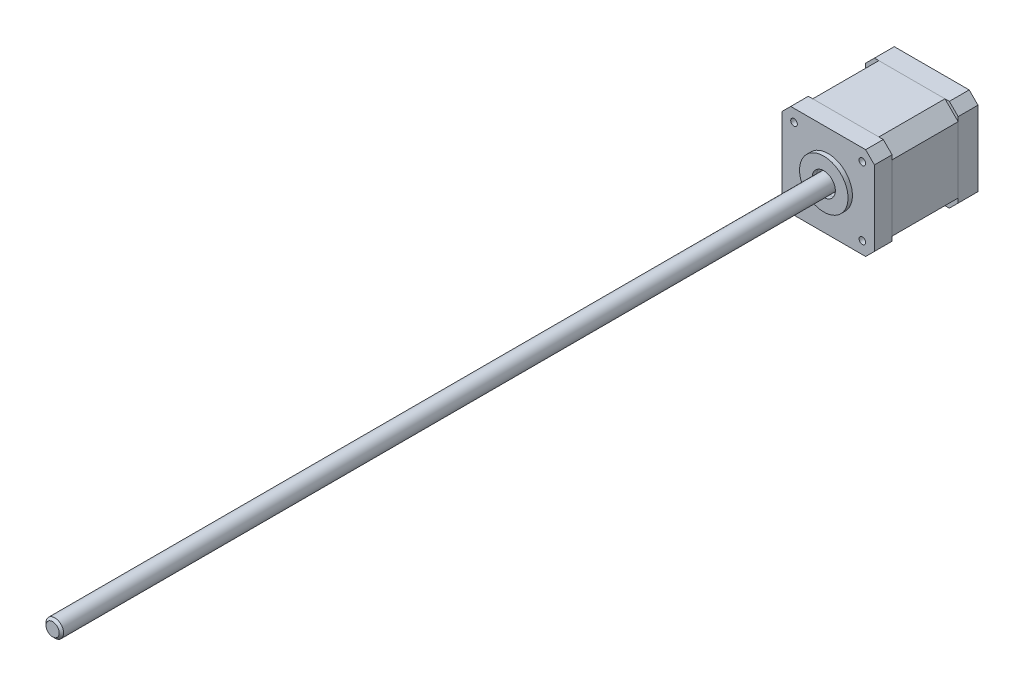
ISO-10303-21;
HEADER;
FILE_DESCRIPTION(('STEP AP214'),'2;1');
FILE_NAME('part.step','',(''),(''),'','','');
FILE_SCHEMA(('AUTOMOTIVE_DESIGN { 1 0 10303 214 1 1 1 1 }'));
ENDSEC;
DATA;
#1=APPLICATION_CONTEXT('core data for automotive mechanical design processes');
#2=APPLICATION_PROTOCOL_DEFINITION('international standard','automotive_design',2000,#1);
#3=PRODUCT_CONTEXT('',#1,'mechanical');
#4=PRODUCT('Part','Part','',(#3));
#5=PRODUCT_RELATED_PRODUCT_CATEGORY('part','',(#4));
#6=PRODUCT_DEFINITION_FORMATION('','',#4);
#7=PRODUCT_DEFINITION_CONTEXT('part definition',#1,'design');
#8=PRODUCT_DEFINITION('design','',#6,#7);
#9=PRODUCT_DEFINITION_SHAPE('','',#8);
#10=(LENGTH_UNIT() NAMED_UNIT(*) SI_UNIT(.MILLI.,.METRE.));
#11=(NAMED_UNIT(*) PLANE_ANGLE_UNIT() SI_UNIT($,.RADIAN.));
#12=(NAMED_UNIT(*) SI_UNIT($,.STERADIAN.) SOLID_ANGLE_UNIT());
#13=UNCERTAINTY_MEASURE_WITH_UNIT(LENGTH_MEASURE(1.E-05),#10,'distance_accuracy_value','');
#14=(GEOMETRIC_REPRESENTATION_CONTEXT(3) GLOBAL_UNCERTAINTY_ASSIGNED_CONTEXT((#13)) GLOBAL_UNIT_ASSIGNED_CONTEXT((#10,
#11,#12)) REPRESENTATION_CONTEXT('',''));
#15=CARTESIAN_POINT('',(0.,0.,0.));
#16=DIRECTION('',(0.,0.,1.));
#17=DIRECTION('',(1.,0.,0.));
#18=AXIS2_PLACEMENT_3D('',#15,#16,#17);
#19=CARTESIAN_POINT('',(0.,0.,736.313708498985));
#20=DIRECTION('',(0.,0.,-1.));
#21=DIRECTION('',(-1.,0.,0.));
#22=AXIS2_PLACEMENT_3D('',#19,#20,#21);
#23=CYLINDRICAL_SURFACE('',#22,4.);
#24=CARTESIAN_POINT('',(0.,0.,374.));
#25=DIRECTION('',(0.,0.,1.));
#26=DIRECTION('',(1.,0.,0.));
#27=AXIS2_PLACEMENT_3D('',#24,#25,#26);
#28=CIRCLE('',#27,4.);
#29=CARTESIAN_POINT('',(4.,0.,374.));
#30=VERTEX_POINT('',#29);
#31=EDGE_CURVE('E11',#30,#30,#28,.F.);
#32=ORIENTED_EDGE('',*,*,#31,.T.);
#33=EDGE_LOOP('',(#32));
#34=FACE_BOUND('',#33,.T.);
#35=CARTESIAN_POINT('',(0.,0.,23.));
#36=DIRECTION('',(0.,0.,1.));
#37=DIRECTION('',(1.,0.,0.));
#38=AXIS2_PLACEMENT_3D('',#35,#36,#37);
#39=CIRCLE('',#38,4.);
#40=CARTESIAN_POINT('',(4.,0.,23.));
#41=VERTEX_POINT('',#40);
#42=EDGE_CURVE('E56',#41,#41,#39,.T.);
#43=ORIENTED_EDGE('',*,*,#42,.T.);
#44=EDGE_LOOP('',(#43));
#45=FACE_BOUND('',#44,.T.);
#46=ADVANCED_FACE('F45',(#34,#45),#23,.T.);
#47=CARTESIAN_POINT('',(0.,0.,23.));
#48=DIRECTION('',(0.,0.,1.));
#49=DIRECTION('',(1.,0.,0.));
#50=AXIS2_PLACEMENT_3D('',#47,#48,#49);
#51=PLANE('',#50);
#52=ORIENTED_EDGE('',*,*,#42,.F.);
#53=EDGE_LOOP('',(#52));
#54=FACE_BOUND('',#53,.T.);
#55=ADVANCED_FACE('F64',(#54),#51,.F.);
#56=CARTESIAN_POINT('',(0.,0.,375.));
#57=DIRECTION('',(0.,0.,1.));
#58=DIRECTION('',(1.,0.,0.));
#59=AXIS2_PLACEMENT_3D('',#56,#57,#58);
#60=PLANE('',#59);
#61=CARTESIAN_POINT('',(0.,0.,375.));
#62=DIRECTION('',(0.,0.,1.));
#63=DIRECTION('',(1.,0.,0.));
#64=AXIS2_PLACEMENT_3D('',#61,#62,#63);
#65=CIRCLE('',#64,3.00000000000006);
#66=CARTESIAN_POINT('',(3.00000000000006,0.,375.));
#67=VERTEX_POINT('',#66);
#68=EDGE_CURVE('E52',#67,#67,#65,.T.);
#69=ORIENTED_EDGE('',*,*,#68,.T.);
#70=EDGE_LOOP('',(#69));
#71=FACE_BOUND('',#70,.T.);
#72=ADVANCED_FACE('F66',(#71),#60,.T.);
#73=CARTESIAN_POINT('',(0.,0.,375.));
#74=DIRECTION('',(0.,0.,-1.));
#75=DIRECTION('',(-1.,0.,0.));
#76=AXIS2_PLACEMENT_3D('',#73,#74,#75);
#77=CONICAL_SURFACE('',#76,3.00000000000006,0.785398163397447);
#78=ORIENTED_EDGE('',*,*,#31,.F.);
#79=EDGE_LOOP('',(#78));
#80=FACE_BOUND('',#79,.T.);
#81=ORIENTED_EDGE('',*,*,#68,.F.);
#82=EDGE_LOOP('',(#81));
#83=FACE_BOUND('',#82,.T.);
#84=ADVANCED_FACE('F47',(#80,#83),#77,.T.);
#85=CLOSED_SHELL('',(#46,#55,#72,#84));
#86=MANIFOLD_SOLID_BREP('B2',#85);
#87=CARTESIAN_POINT('',(0.,0.,25.));
#88=DIRECTION('',(0.,0.,-1.));
#89=DIRECTION('',(-1.,0.,0.));
#90=AXIS2_PLACEMENT_3D('',#87,#88,#89);
#91=CYLINDRICAL_SURFACE('',#90,11.);
#92=CARTESIAN_POINT('',(0.,0.,25.));
#93=DIRECTION('',(0.,0.,1.));
#94=DIRECTION('',(1.,0.,0.));
#95=AXIS2_PLACEMENT_3D('',#92,#93,#94);
#96=CIRCLE('',#95,11.);
#97=CARTESIAN_POINT('',(11.,0.,25.));
#98=VERTEX_POINT('',#97);
#99=EDGE_CURVE('E44',#98,#98,#96,.T.);
#100=ORIENTED_EDGE('',*,*,#99,.F.);
#101=EDGE_LOOP('',(#100));
#102=FACE_BOUND('',#101,.T.);
#103=CARTESIAN_POINT('',(0.,0.,23.));
#104=DIRECTION('',(0.,0.,1.));
#105=DIRECTION('',(1.,0.,0.));
#106=AXIS2_PLACEMENT_3D('',#103,#104,#105);
#107=CIRCLE('',#106,11.);
#108=CARTESIAN_POINT('',(11.,0.,23.));
#109=VERTEX_POINT('',#108);
#110=EDGE_CURVE('E118',#109,#109,#107,.T.);
#111=ORIENTED_EDGE('',*,*,#110,.T.);
#112=EDGE_LOOP('',(#111));
#113=FACE_BOUND('',#112,.T.);
#114=ADVANCED_FACE('F111',(#102,#113),#91,.T.);
#115=CARTESIAN_POINT('',(0.,0.,25.));
#116=DIRECTION('',(0.,0.,1.));
#117=DIRECTION('',(1.,0.,0.));
#118=AXIS2_PLACEMENT_3D('',#115,#116,#117);
#119=PLANE('',#118);
#120=CARTESIAN_POINT('',(0.,0.,25.));
#121=DIRECTION('',(0.,0.,1.));
#122=DIRECTION('',(1.,0.,0.));
#123=AXIS2_PLACEMENT_3D('',#120,#121,#122);
#124=CIRCLE('',#123,5.25);
#125=CARTESIAN_POINT('',(5.25,0.,25.));
#126=VERTEX_POINT('',#125);
#127=EDGE_CURVE('E124',#126,#126,#124,.T.);
#128=ORIENTED_EDGE('',*,*,#127,.F.);
#129=EDGE_LOOP('',(#128));
#130=FACE_BOUND('',#129,.T.);
#131=ORIENTED_EDGE('',*,*,#99,.T.);
#132=EDGE_LOOP('',(#131));
#133=FACE_BOUND('',#132,.T.);
#134=ADVANCED_FACE('F140',(#130,#133),#119,.T.);
#135=CARTESIAN_POINT('',(0.,0.,23.));
#136=DIRECTION('',(0.,0.,1.));
#137=DIRECTION('',(1.,0.,0.));
#138=AXIS2_PLACEMENT_3D('',#135,#136,#137);
#139=PLANE('',#138);
#140=CARTESIAN_POINT('',(0.,0.,23.));
#141=DIRECTION('',(0.,0.,1.));
#142=DIRECTION('',(1.,0.,0.));
#143=AXIS2_PLACEMENT_3D('',#140,#141,#142);
#144=CIRCLE('',#143,5.25);
#145=CARTESIAN_POINT('',(5.25,0.,23.));
#146=VERTEX_POINT('',#145);
#147=EDGE_CURVE('E114',#146,#146,#144,.T.);
#148=ORIENTED_EDGE('',*,*,#147,.T.);
#149=EDGE_LOOP('',(#148));
#150=FACE_BOUND('',#149,.T.);
#151=ORIENTED_EDGE('',*,*,#110,.F.);
#152=EDGE_LOOP('',(#151));
#153=FACE_BOUND('',#152,.T.);
#154=ADVANCED_FACE('F131',(#150,#153),#139,.F.);
#155=CARTESIAN_POINT('',(0.,0.,20.));
#156=DIRECTION('',(0.,0.,1.));
#157=DIRECTION('',(1.,0.,0.));
#158=AXIS2_PLACEMENT_3D('',#155,#156,#157);
#159=CYLINDRICAL_SURFACE('',#158,5.25);
#160=ORIENTED_EDGE('',*,*,#127,.T.);
#161=EDGE_LOOP('',(#160));
#162=FACE_BOUND('',#161,.T.);
#163=ORIENTED_EDGE('',*,*,#147,.F.);
#164=EDGE_LOOP('',(#163));
#165=FACE_BOUND('',#164,.T.);
#166=ADVANCED_FACE('F134',(#162,#165),#159,.F.);
#167=CLOSED_SHELL('',(#114,#134,#154,#166));
#168=MANIFOLD_SOLID_BREP('B6',#167);
#169=CARTESIAN_POINT('',(-21.,-21.,-24.));
#170=DIRECTION('',(1.,0.,0.));
#171=DIRECTION('',(0.,0.,-1.));
#172=AXIS2_PLACEMENT_3D('',#169,#170,#171);
#173=PLANE('',#172);
#174=DIRECTION('',(0.,1.,0.));
#175=VECTOR('',#174,1.);
#176=CARTESIAN_POINT('',(-21.,-21.,-24.));
#177=LINE('',#176,#175);
#178=CARTESIAN_POINT('',(-21.,-17.,-24.));
#179=VERTEX_POINT('',#178);
#180=CARTESIAN_POINT('',(-21.,17.,-24.));
#181=VERTEX_POINT('',#180);
#182=EDGE_CURVE('E272',#179,#181,#177,.T.);
#183=ORIENTED_EDGE('',*,*,#182,.F.);
#184=DIRECTION('',(0.,0.,1.));
#185=VECTOR('',#184,1.);
#186=CARTESIAN_POINT('',(-21.,-17.,-24.));
#187=LINE('',#186,#185);
#188=CARTESIAN_POINT('',(-21.,-17.,-15.));
#189=VERTEX_POINT('',#188);
#190=EDGE_CURVE('E257',#179,#189,#187,.T.);
#191=ORIENTED_EDGE('',*,*,#190,.T.);
#192=DIRECTION('',(0.,1.,0.));
#193=VECTOR('',#192,1.);
#194=CARTESIAN_POINT('',(-21.,-21.,-15.));
#195=LINE('',#194,#193);
#196=CARTESIAN_POINT('',(-21.,17.,-15.));
#197=VERTEX_POINT('',#196);
#198=EDGE_CURVE('E269',#189,#197,#195,.T.);
#199=ORIENTED_EDGE('',*,*,#198,.T.);
#200=DIRECTION('',(0.,0.,-1.));
#201=VECTOR('',#200,1.);
#202=CARTESIAN_POINT('',(-21.,17.,-24.));
#203=LINE('',#202,#201);
#204=EDGE_CURVE('E274',#197,#181,#203,.T.);
#205=ORIENTED_EDGE('',*,*,#204,.T.);
#206=EDGE_LOOP('',(#183,#191,#199,#205));
#207=FACE_BOUND('',#206,.T.);
#208=ADVANCED_FACE('F186',(#207),#173,.F.);
#209=CARTESIAN_POINT('',(21.,21.,-24.));
#210=DIRECTION('',(0.,-1.,0.));
#211=DIRECTION('',(0.,0.,-1.));
#212=AXIS2_PLACEMENT_3D('',#209,#210,#211);
#213=PLANE('',#212);
#214=DIRECTION('',(1.,0.,0.));
#215=VECTOR('',#214,1.);
#216=CARTESIAN_POINT('',(21.,21.,-24.));
#217=LINE('',#216,#215);
#218=CARTESIAN_POINT('',(-17.,21.,-24.));
#219=VERTEX_POINT('',#218);
#220=CARTESIAN_POINT('',(17.,21.,-24.));
#221=VERTEX_POINT('',#220);
#222=EDGE_CURVE('E312',#219,#221,#217,.T.);
#223=ORIENTED_EDGE('',*,*,#222,.F.);
#224=DIRECTION('',(0.,0.,1.));
#225=VECTOR('',#224,1.);
#226=CARTESIAN_POINT('',(-17.,21.,-24.));
#227=LINE('',#226,#225);
#228=CARTESIAN_POINT('',(-17.,21.,-15.));
#229=VERTEX_POINT('',#228);
#230=EDGE_CURVE('E109',#219,#229,#227,.T.);
#231=ORIENTED_EDGE('',*,*,#230,.T.);
#232=DIRECTION('',(1.,0.,0.));
#233=VECTOR('',#232,1.);
#234=CARTESIAN_POINT('',(21.,21.,-15.));
#235=LINE('',#234,#233);
#236=CARTESIAN_POINT('',(17.,21.,-15.));
#237=VERTEX_POINT('',#236);
#238=EDGE_CURVE('E279',#229,#237,#235,.T.);
#239=ORIENTED_EDGE('',*,*,#238,.T.);
#240=DIRECTION('',(0.,0.,-1.));
#241=VECTOR('',#240,1.);
#242=CARTESIAN_POINT('',(17.,21.,-24.));
#243=LINE('',#242,#241);
#244=EDGE_CURVE('E194',#237,#221,#243,.T.);
#245=ORIENTED_EDGE('',*,*,#244,.T.);
#246=EDGE_LOOP('',(#223,#231,#239,#245));
#247=FACE_BOUND('',#246,.T.);
#248=ADVANCED_FACE('F311',(#247),#213,.F.);
#249=CARTESIAN_POINT('',(21.,-21.,-24.));
#250=DIRECTION('',(-1.,0.,0.));
#251=DIRECTION('',(0.,0.,1.));
#252=AXIS2_PLACEMENT_3D('',#249,#250,#251);
#253=PLANE('',#252);
#254=DIRECTION('',(0.,-1.,0.));
#255=VECTOR('',#254,1.);
#256=CARTESIAN_POINT('',(21.,-21.,-15.));
#257=LINE('',#256,#255);
#258=CARTESIAN_POINT('',(21.,17.,-15.));
#259=VERTEX_POINT('',#258);
#260=CARTESIAN_POINT('',(21.,-17.,-15.));
#261=VERTEX_POINT('',#260);
#262=EDGE_CURVE('E282',#259,#261,#257,.T.);
#263=ORIENTED_EDGE('',*,*,#262,.T.);
#264=DIRECTION('',(0.,0.,-1.));
#265=VECTOR('',#264,1.);
#266=CARTESIAN_POINT('',(21.,-17.,-24.));
#267=LINE('',#266,#265);
#268=CARTESIAN_POINT('',(21.,-17.,-24.));
#269=VERTEX_POINT('',#268);
#270=EDGE_CURVE('E201',#261,#269,#267,.T.);
#271=ORIENTED_EDGE('',*,*,#270,.T.);
#272=DIRECTION('',(0.,-1.,0.));
#273=VECTOR('',#272,1.);
#274=CARTESIAN_POINT('',(21.,-21.,-24.));
#275=LINE('',#274,#273);
#276=CARTESIAN_POINT('',(21.,17.,-24.));
#277=VERTEX_POINT('',#276);
#278=EDGE_CURVE('E318',#277,#269,#275,.T.);
#279=ORIENTED_EDGE('',*,*,#278,.F.);
#280=DIRECTION('',(0.,0.,1.));
#281=VECTOR('',#280,1.);
#282=CARTESIAN_POINT('',(21.,17.,-24.));
#283=LINE('',#282,#281);
#284=EDGE_CURVE('E305',#277,#259,#283,.T.);
#285=ORIENTED_EDGE('',*,*,#284,.T.);
#286=EDGE_LOOP('',(#263,#271,#279,#285));
#287=FACE_BOUND('',#286,.T.);
#288=ADVANCED_FACE('F322',(#287),#253,.F.);
#289=CARTESIAN_POINT('',(21.,-21.,-24.));
#290=DIRECTION('',(0.,1.,0.));
#291=DIRECTION('',(0.,0.,1.));
#292=AXIS2_PLACEMENT_3D('',#289,#290,#291);
#293=PLANE('',#292);
#294=DIRECTION('',(-1.,0.,0.));
#295=VECTOR('',#294,1.);
#296=CARTESIAN_POINT('',(21.,-21.,-15.));
#297=LINE('',#296,#295);
#298=CARTESIAN_POINT('',(17.,-21.,-15.));
#299=VERTEX_POINT('',#298);
#300=CARTESIAN_POINT('',(-17.,-21.,-15.));
#301=VERTEX_POINT('',#300);
#302=EDGE_CURVE('E289',#299,#301,#297,.T.);
#303=ORIENTED_EDGE('',*,*,#302,.T.);
#304=DIRECTION('',(0.,0.,-1.));
#305=VECTOR('',#304,1.);
#306=CARTESIAN_POINT('',(-17.,-21.,-24.));
#307=LINE('',#306,#305);
#308=CARTESIAN_POINT('',(-17.,-21.,-24.));
#309=VERTEX_POINT('',#308);
#310=EDGE_CURVE('E258',#301,#309,#307,.T.);
#311=ORIENTED_EDGE('',*,*,#310,.T.);
#312=DIRECTION('',(-1.,0.,0.));
#313=VECTOR('',#312,1.);
#314=CARTESIAN_POINT('',(21.,-21.,-24.));
#315=LINE('',#314,#313);
#316=CARTESIAN_POINT('',(17.,-21.,-24.));
#317=VERTEX_POINT('',#316);
#318=EDGE_CURVE('E285',#317,#309,#315,.T.);
#319=ORIENTED_EDGE('',*,*,#318,.F.);
#320=DIRECTION('',(0.,0.,1.));
#321=VECTOR('',#320,1.);
#322=CARTESIAN_POINT('',(17.,-21.,-24.));
#323=LINE('',#322,#321);
#324=EDGE_CURVE('E263',#317,#299,#323,.T.);
#325=ORIENTED_EDGE('',*,*,#324,.T.);
#326=EDGE_LOOP('',(#303,#311,#319,#325));
#327=FACE_BOUND('',#326,.T.);
#328=ADVANCED_FACE('F329',(#327),#293,.F.);
#329=CARTESIAN_POINT('',(0.,0.,-24.));
#330=DIRECTION('',(0.,0.,1.));
#331=DIRECTION('',(1.,0.,0.));
#332=AXIS2_PLACEMENT_3D('',#329,#330,#331);
#333=PLANE('',#332);
#334=ORIENTED_EDGE('',*,*,#318,.T.);
#335=DIRECTION('',(0.70710678118655,-0.707106781186545,0.));
#336=VECTOR('',#335,1.);
#337=CARTESIAN_POINT('',(-21.,-17.,-24.));
#338=LINE('',#337,#336);
#339=EDGE_CURVE('E303',#309,#179,#338,.F.);
#340=ORIENTED_EDGE('',*,*,#339,.T.);
#341=ORIENTED_EDGE('',*,*,#182,.T.);
#342=DIRECTION('',(-0.707106781186545,-0.70710678118655,0.));
#343=VECTOR('',#342,1.);
#344=CARTESIAN_POINT('',(-17.,21.,-24.));
#345=LINE('',#344,#343);
#346=EDGE_CURVE('E299',#181,#219,#345,.F.);
#347=ORIENTED_EDGE('',*,*,#346,.T.);
#348=ORIENTED_EDGE('',*,*,#222,.T.);
#349=DIRECTION('',(-0.707106781186549,0.707106781186546,0.));
#350=VECTOR('',#349,1.);
#351=CARTESIAN_POINT('',(21.,17.,-24.));
#352=LINE('',#351,#350);
#353=EDGE_CURVE('E208',#221,#277,#352,.F.);
#354=ORIENTED_EDGE('',*,*,#353,.T.);
#355=ORIENTED_EDGE('',*,*,#278,.T.);
#356=DIRECTION('',(0.707106781186546,0.707106781186549,0.));
#357=VECTOR('',#356,1.);
#358=CARTESIAN_POINT('',(17.,-21.,-24.));
#359=LINE('',#358,#357);
#360=EDGE_CURVE('E301',#269,#317,#359,.F.);
#361=ORIENTED_EDGE('',*,*,#360,.T.);
#362=EDGE_LOOP('',(#334,#340,#341,#347,#348,#354,#355,#361));
#363=FACE_BOUND('',#362,.T.);
#364=ADVANCED_FACE('F316',(#363),#333,.F.);
#365=CARTESIAN_POINT('',(0.,0.,-15.));
#366=DIRECTION('',(0.,0.,1.));
#367=DIRECTION('',(1.,0.,0.));
#368=AXIS2_PLACEMENT_3D('',#365,#366,#367);
#369=PLANE('',#368);
#370=ORIENTED_EDGE('',*,*,#198,.F.);
#371=DIRECTION('',(-0.70710678118655,0.707106781186545,0.));
#372=VECTOR('',#371,1.);
#373=CARTESIAN_POINT('',(-18.9999999999999,-19.0000000000001,-15.));
#374=LINE('',#373,#372);
#375=EDGE_CURVE('E253',#189,#301,#374,.F.);
#376=ORIENTED_EDGE('',*,*,#375,.T.);
#377=ORIENTED_EDGE('',*,*,#302,.F.);
#378=DIRECTION('',(-0.707106781186546,-0.707106781186549,0.));
#379=VECTOR('',#378,1.);
#380=CARTESIAN_POINT('',(19.,-19.,-15.));
#381=LINE('',#380,#379);
#382=EDGE_CURVE('E264',#299,#261,#381,.F.);
#383=ORIENTED_EDGE('',*,*,#382,.T.);
#384=ORIENTED_EDGE('',*,*,#262,.F.);
#385=DIRECTION('',(0.707106781186549,-0.707106781186546,0.));
#386=VECTOR('',#385,1.);
#387=CARTESIAN_POINT('',(18.9999999999999,19.,-15.));
#388=LINE('',#387,#386);
#389=EDGE_CURVE('E273',#259,#237,#388,.F.);
#390=ORIENTED_EDGE('',*,*,#389,.T.);
#391=ORIENTED_EDGE('',*,*,#238,.F.);
#392=DIRECTION('',(0.707106781186545,0.70710678118655,0.));
#393=VECTOR('',#392,1.);
#394=CARTESIAN_POINT('',(-19.0000000000001,18.9999999999999,-15.));
#395=LINE('',#394,#393);
#396=EDGE_CURVE('E278',#229,#197,#395,.F.);
#397=ORIENTED_EDGE('',*,*,#396,.T.);
#398=EDGE_LOOP('',(#370,#376,#377,#383,#384,#390,#391,#397));
#399=FACE_BOUND('',#398,.T.);
#400=ADVANCED_FACE('F276',(#399),#369,.T.);
#401=CARTESIAN_POINT('',(-21.,-17.,-24.));
#402=DIRECTION('',(0.707106781186545,0.70710678118655,0.));
#403=DIRECTION('',(0.,0.,1.));
#404=AXIS2_PLACEMENT_3D('',#401,#402,#403);
#405=PLANE('',#404);
#406=ORIENTED_EDGE('',*,*,#339,.F.);
#407=ORIENTED_EDGE('',*,*,#310,.F.);
#408=ORIENTED_EDGE('',*,*,#375,.F.);
#409=ORIENTED_EDGE('',*,*,#190,.F.);
#410=EDGE_LOOP('',(#406,#407,#408,#409));
#411=FACE_BOUND('',#410,.T.);
#412=ADVANCED_FACE('F256',(#411),#405,.F.);
#413=CARTESIAN_POINT('',(17.,-21.,-24.));
#414=DIRECTION('',(-0.707106781186549,0.707106781186546,0.));
#415=DIRECTION('',(0.,0.,1.));
#416=AXIS2_PLACEMENT_3D('',#413,#414,#415);
#417=PLANE('',#416);
#418=ORIENTED_EDGE('',*,*,#360,.F.);
#419=ORIENTED_EDGE('',*,*,#270,.F.);
#420=ORIENTED_EDGE('',*,*,#382,.F.);
#421=ORIENTED_EDGE('',*,*,#324,.F.);
#422=EDGE_LOOP('',(#418,#419,#420,#421));
#423=FACE_BOUND('',#422,.T.);
#424=ADVANCED_FACE('F326',(#423),#417,.F.);
#425=CARTESIAN_POINT('',(-17.,21.,-24.));
#426=DIRECTION('',(0.70710678118655,-0.707106781186545,0.));
#427=DIRECTION('',(0.,0.,1.));
#428=AXIS2_PLACEMENT_3D('',#425,#426,#427);
#429=PLANE('',#428);
#430=ORIENTED_EDGE('',*,*,#346,.F.);
#431=ORIENTED_EDGE('',*,*,#204,.F.);
#432=ORIENTED_EDGE('',*,*,#396,.F.);
#433=ORIENTED_EDGE('',*,*,#230,.F.);
#434=EDGE_LOOP('',(#430,#431,#432,#433));
#435=FACE_BOUND('',#434,.T.);
#436=ADVANCED_FACE('F332',(#435),#429,.F.);
#437=CARTESIAN_POINT('',(21.,17.,-24.));
#438=DIRECTION('',(-0.707106781186546,-0.707106781186549,0.));
#439=DIRECTION('',(0.,0.,1.));
#440=AXIS2_PLACEMENT_3D('',#437,#438,#439);
#441=PLANE('',#440);
#442=ORIENTED_EDGE('',*,*,#353,.F.);
#443=ORIENTED_EDGE('',*,*,#244,.F.);
#444=ORIENTED_EDGE('',*,*,#389,.F.);
#445=ORIENTED_EDGE('',*,*,#284,.F.);
#446=EDGE_LOOP('',(#442,#443,#444,#445));
#447=FACE_BOUND('',#446,.T.);
#448=ADVANCED_FACE('F188',(#447),#441,.F.);
#449=CLOSED_SHELL('',(#208,#248,#288,#328,#364,#400,#412,#424,#436,#448));
#450=MANIFOLD_SOLID_BREP('B39',#449);
#451=CARTESIAN_POINT('',(21.,-21.,23.));
#452=DIRECTION('',(-1.,0.,0.));
#453=DIRECTION('',(0.,0.,1.));
#454=AXIS2_PLACEMENT_3D('',#451,#452,#453);
#455=PLANE('',#454);
#456=DIRECTION('',(0.,1.,0.));
#457=VECTOR('',#456,1.);
#458=CARTESIAN_POINT('',(21.,-21.,23.));
#459=LINE('',#458,#457);
#460=CARTESIAN_POINT('',(21.,-17.,23.));
#461=VERTEX_POINT('',#460);
#462=CARTESIAN_POINT('',(21.,17.,23.));
#463=VERTEX_POINT('',#462);
#464=EDGE_CURVE('E515',#461,#463,#459,.T.);
#465=ORIENTED_EDGE('',*,*,#464,.F.);
#466=DIRECTION('',(0.,0.,-1.));
#467=VECTOR('',#466,1.);
#468=CARTESIAN_POINT('',(21.,-17.,23.));
#469=LINE('',#468,#467);
#470=CARTESIAN_POINT('',(21.,-17.,15.));
#471=VERTEX_POINT('',#470);
#472=EDGE_CURVE('E541',#461,#471,#469,.T.);
#473=ORIENTED_EDGE('',*,*,#472,.T.);
#474=DIRECTION('',(0.,1.,0.));
#475=VECTOR('',#474,1.);
#476=CARTESIAN_POINT('',(21.,-21.,15.));
#477=LINE('',#476,#475);
#478=CARTESIAN_POINT('',(21.,17.,15.));
#479=VERTEX_POINT('',#478);
#480=EDGE_CURVE('E548',#471,#479,#477,.T.);
#481=ORIENTED_EDGE('',*,*,#480,.T.);
#482=DIRECTION('',(0.,0.,1.));
#483=VECTOR('',#482,1.);
#484=CARTESIAN_POINT('',(21.,17.,23.));
#485=LINE('',#484,#483);
#486=EDGE_CURVE('E539',#479,#463,#485,.T.);
#487=ORIENTED_EDGE('',*,*,#486,.T.);
#488=EDGE_LOOP('',(#465,#473,#481,#487));
#489=FACE_BOUND('',#488,.T.);
#490=ADVANCED_FACE('F422',(#489),#455,.F.);
#491=CARTESIAN_POINT('',(-21.,21.,23.));
#492=DIRECTION('',(0.,-1.,0.));
#493=DIRECTION('',(0.,0.,-1.));
#494=AXIS2_PLACEMENT_3D('',#491,#492,#493);
#495=PLANE('',#494);
#496=DIRECTION('',(-1.,0.,0.));
#497=VECTOR('',#496,1.);
#498=CARTESIAN_POINT('',(-21.,21.,23.));
#499=LINE('',#498,#497);
#500=CARTESIAN_POINT('',(17.,21.,23.));
#501=VERTEX_POINT('',#500);
#502=CARTESIAN_POINT('',(-17.,21.,23.));
#503=VERTEX_POINT('',#502);
#504=EDGE_CURVE('E518',#501,#503,#499,.T.);
#505=ORIENTED_EDGE('',*,*,#504,.F.);
#506=DIRECTION('',(0.,0.,-1.));
#507=VECTOR('',#506,1.);
#508=CARTESIAN_POINT('',(17.,21.,23.));
#509=LINE('',#508,#507);
#510=CARTESIAN_POINT('',(17.,21.,15.));
#511=VERTEX_POINT('',#510);
#512=EDGE_CURVE('E184',#501,#511,#509,.T.);
#513=ORIENTED_EDGE('',*,*,#512,.T.);
#514=DIRECTION('',(-1.,0.,0.));
#515=VECTOR('',#514,1.);
#516=CARTESIAN_POINT('',(-21.,21.,15.));
#517=LINE('',#516,#515);
#518=CARTESIAN_POINT('',(-17.,21.,15.));
#519=VERTEX_POINT('',#518);
#520=EDGE_CURVE('E520',#511,#519,#517,.T.);
#521=ORIENTED_EDGE('',*,*,#520,.T.);
#522=DIRECTION('',(0.,0.,1.));
#523=VECTOR('',#522,1.);
#524=CARTESIAN_POINT('',(-17.,21.,23.));
#525=LINE('',#524,#523);
#526=EDGE_CURVE('E431',#519,#503,#525,.T.);
#527=ORIENTED_EDGE('',*,*,#526,.T.);
#528=EDGE_LOOP('',(#505,#513,#521,#527));
#529=FACE_BOUND('',#528,.T.);
#530=ADVANCED_FACE('F608',(#529),#495,.F.);
#531=CARTESIAN_POINT('',(-21.,-21.,23.));
#532=DIRECTION('',(1.,0.,0.));
#533=DIRECTION('',(0.,0.,-1.));
#534=AXIS2_PLACEMENT_3D('',#531,#532,#533);
#535=PLANE('',#534);
#536=DIRECTION('',(0.,-1.,0.));
#537=VECTOR('',#536,1.);
#538=CARTESIAN_POINT('',(-21.,-21.,15.));
#539=LINE('',#538,#537);
#540=CARTESIAN_POINT('',(-21.,17.,15.));
#541=VERTEX_POINT('',#540);
#542=CARTESIAN_POINT('',(-21.,-17.,15.));
#543=VERTEX_POINT('',#542);
#544=EDGE_CURVE('E516',#541,#543,#539,.T.);
#545=ORIENTED_EDGE('',*,*,#544,.T.);
#546=DIRECTION('',(0.,0.,1.));
#547=VECTOR('',#546,1.);
#548=CARTESIAN_POINT('',(-21.,-17.,23.));
#549=LINE('',#548,#547);
#550=CARTESIAN_POINT('',(-21.,-17.,23.));
#551=VERTEX_POINT('',#550);
#552=EDGE_CURVE('E494',#543,#551,#549,.T.);
#553=ORIENTED_EDGE('',*,*,#552,.T.);
#554=DIRECTION('',(0.,-1.,0.));
#555=VECTOR('',#554,1.);
#556=CARTESIAN_POINT('',(-21.,-21.,23.));
#557=LINE('',#556,#555);
#558=CARTESIAN_POINT('',(-21.,17.,23.));
#559=VERTEX_POINT('',#558);
#560=EDGE_CURVE('E558',#559,#551,#557,.T.);
#561=ORIENTED_EDGE('',*,*,#560,.F.);
#562=DIRECTION('',(0.,0.,-1.));
#563=VECTOR('',#562,1.);
#564=CARTESIAN_POINT('',(-21.,17.,23.));
#565=LINE('',#564,#563);
#566=EDGE_CURVE('E499',#559,#541,#565,.T.);
#567=ORIENTED_EDGE('',*,*,#566,.T.);
#568=EDGE_LOOP('',(#545,#553,#561,#567));
#569=FACE_BOUND('',#568,.T.);
#570=ADVANCED_FACE('F606',(#569),#535,.F.);
#571=CARTESIAN_POINT('',(-21.,-21.,23.));
#572=DIRECTION('',(0.,1.,0.));
#573=DIRECTION('',(0.,0.,1.));
#574=AXIS2_PLACEMENT_3D('',#571,#572,#573);
#575=PLANE('',#574);
#576=DIRECTION('',(1.,0.,0.));
#577=VECTOR('',#576,1.);
#578=CARTESIAN_POINT('',(-21.,-21.,23.));
#579=LINE('',#578,#577);
#580=CARTESIAN_POINT('',(-17.,-21.,23.));
#581=VERTEX_POINT('',#580);
#582=CARTESIAN_POINT('',(17.,-21.,23.));
#583=VERTEX_POINT('',#582);
#584=EDGE_CURVE('E509',#581,#583,#579,.T.);
#585=ORIENTED_EDGE('',*,*,#584,.F.);
#586=DIRECTION('',(0.,0.,-1.));
#587=VECTOR('',#586,1.);
#588=CARTESIAN_POINT('',(-17.,-21.,23.));
#589=LINE('',#588,#587);
#590=CARTESIAN_POINT('',(-17.,-21.,15.));
#591=VERTEX_POINT('',#590);
#592=EDGE_CURVE('E493',#581,#591,#589,.T.);
#593=ORIENTED_EDGE('',*,*,#592,.T.);
#594=DIRECTION('',(1.,0.,0.));
#595=VECTOR('',#594,1.);
#596=CARTESIAN_POINT('',(-21.,-21.,15.));
#597=LINE('',#596,#595);
#598=CARTESIAN_POINT('',(17.,-21.,15.));
#599=VERTEX_POINT('',#598);
#600=EDGE_CURVE('E506',#591,#599,#597,.T.);
#601=ORIENTED_EDGE('',*,*,#600,.T.);
#602=DIRECTION('',(0.,0.,1.));
#603=VECTOR('',#602,1.);
#604=CARTESIAN_POINT('',(17.,-21.,23.));
#605=LINE('',#604,#603);
#606=EDGE_CURVE('E511',#599,#583,#605,.T.);
#607=ORIENTED_EDGE('',*,*,#606,.T.);
#608=EDGE_LOOP('',(#585,#593,#601,#607));
#609=FACE_BOUND('',#608,.T.);
#610=ADVANCED_FACE('F505',(#609),#575,.F.);
#611=CARTESIAN_POINT('',(0.,0.,23.));
#612=DIRECTION('',(0.,0.,-1.));
#613=DIRECTION('',(-1.,0.,0.));
#614=AXIS2_PLACEMENT_3D('',#611,#612,#613);
#615=PLANE('',#614);
#616=CARTESIAN_POINT('',(-15.4999999999999,-15.5000000000001,23.));
#617=DIRECTION('',(0.,0.,1.));
#618=DIRECTION('',(0.,1.,0.));
#619=AXIS2_PLACEMENT_3D('',#616,#617,#618);
#620=CIRCLE('',#619,1.5);
#621=CARTESIAN_POINT('',(-15.5,-14.0000000000001,23.));
#622=VERTEX_POINT('',#621);
#623=EDGE_CURVE('E581',#622,#622,#620,.T.);
#624=ORIENTED_EDGE('',*,*,#623,.F.);
#625=EDGE_LOOP('',(#624));
#626=FACE_BOUND('',#625,.T.);
#627=CARTESIAN_POINT('',(15.5,-15.5,23.));
#628=DIRECTION('',(0.,0.,1.));
#629=DIRECTION('',(-1.,0.,0.));
#630=AXIS2_PLACEMENT_3D('',#627,#628,#629);
#631=CIRCLE('',#630,1.5);
#632=CARTESIAN_POINT('',(14.,-15.5,23.));
#633=VERTEX_POINT('',#632);
#634=EDGE_CURVE('E574',#633,#633,#631,.T.);
#635=ORIENTED_EDGE('',*,*,#634,.F.);
#636=EDGE_LOOP('',(#635));
#637=FACE_BOUND('',#636,.T.);
#638=CARTESIAN_POINT('',(15.4999999999998,15.5000000000002,23.));
#639=DIRECTION('',(0.,0.,1.));
#640=DIRECTION('',(0.,-1.,0.));
#641=AXIS2_PLACEMENT_3D('',#638,#639,#640);
#642=CIRCLE('',#641,1.5);
#643=CARTESIAN_POINT('',(15.4999999999999,14.0000000000002,23.));
#644=VERTEX_POINT('',#643);
#645=EDGE_CURVE('E575',#644,#644,#642,.T.);
#646=ORIENTED_EDGE('',*,*,#645,.F.);
#647=EDGE_LOOP('',(#646));
#648=FACE_BOUND('',#647,.T.);
#649=CARTESIAN_POINT('',(-15.5,15.5,23.));
#650=DIRECTION('',(0.,0.,1.));
#651=DIRECTION('',(1.,0.,0.));
#652=AXIS2_PLACEMENT_3D('',#649,#650,#651);
#653=CIRCLE('',#652,1.5);
#654=CARTESIAN_POINT('',(-14.,15.5,23.));
#655=VERTEX_POINT('',#654);
#656=EDGE_CURVE('E565',#655,#655,#653,.T.);
#657=ORIENTED_EDGE('',*,*,#656,.F.);
#658=EDGE_LOOP('',(#657));
#659=FACE_BOUND('',#658,.T.);
#660=CARTESIAN_POINT('',(0.,0.,23.));
#661=DIRECTION('',(0.,0.,-1.));
#662=DIRECTION('',(-1.,0.,0.));
#663=AXIS2_PLACEMENT_3D('',#660,#661,#662);
#664=CIRCLE('',#663,5.25);
#665=CARTESIAN_POINT('',(-5.25,0.,23.));
#666=VERTEX_POINT('',#665);
#667=EDGE_CURVE('E426',#666,#666,#664,.T.);
#668=ORIENTED_EDGE('',*,*,#667,.T.);
#669=EDGE_LOOP('',(#668));
#670=FACE_BOUND('',#669,.T.);
#671=ORIENTED_EDGE('',*,*,#560,.T.);
#672=DIRECTION('',(-0.707106781186546,0.707106781186549,0.));
#673=VECTOR('',#672,1.);
#674=CARTESIAN_POINT('',(-17.,-21.,23.));
#675=LINE('',#674,#673);
#676=EDGE_CURVE('E537',#551,#581,#675,.F.);
#677=ORIENTED_EDGE('',*,*,#676,.T.);
#678=ORIENTED_EDGE('',*,*,#584,.T.);
#679=DIRECTION('',(-0.707106781186549,-0.707106781186546,0.));
#680=VECTOR('',#679,1.);
#681=CARTESIAN_POINT('',(21.,-17.,23.));
#682=LINE('',#681,#680);
#683=EDGE_CURVE('E535',#583,#461,#682,.F.);
#684=ORIENTED_EDGE('',*,*,#683,.T.);
#685=ORIENTED_EDGE('',*,*,#464,.T.);
#686=DIRECTION('',(0.707106781186547,-0.707106781186548,0.));
#687=VECTOR('',#686,1.);
#688=CARTESIAN_POINT('',(17.,21.,23.));
#689=LINE('',#688,#687);
#690=EDGE_CURVE('E444',#463,#501,#689,.F.);
#691=ORIENTED_EDGE('',*,*,#690,.T.);
#692=ORIENTED_EDGE('',*,*,#504,.T.);
#693=DIRECTION('',(0.707106781186548,0.707106781186547,0.));
#694=VECTOR('',#693,1.);
#695=CARTESIAN_POINT('',(-21.,17.,23.));
#696=LINE('',#695,#694);
#697=EDGE_CURVE('E532',#503,#559,#696,.F.);
#698=ORIENTED_EDGE('',*,*,#697,.T.);
#699=EDGE_LOOP('',(#671,#677,#678,#684,#685,#691,#692,#698));
#700=FACE_BOUND('',#699,.T.);
#701=ADVANCED_FACE('F591',(#626,#637,#648,#659,#670,#700),#615,.F.);
#702=CARTESIAN_POINT('',(0.,0.,15.));
#703=DIRECTION('',(0.,0.,-1.));
#704=DIRECTION('',(-1.,0.,0.));
#705=AXIS2_PLACEMENT_3D('',#702,#703,#704);
#706=PLANE('',#705);
#707=ORIENTED_EDGE('',*,*,#600,.F.);
#708=DIRECTION('',(0.707106781186546,-0.707106781186549,0.));
#709=VECTOR('',#708,1.);
#710=CARTESIAN_POINT('',(-19.,-19.,15.));
#711=LINE('',#710,#709);
#712=EDGE_CURVE('E489',#591,#543,#711,.F.);
#713=ORIENTED_EDGE('',*,*,#712,.T.);
#714=ORIENTED_EDGE('',*,*,#544,.F.);
#715=DIRECTION('',(-0.707106781186548,-0.707106781186547,0.));
#716=VECTOR('',#715,1.);
#717=CARTESIAN_POINT('',(-19.,19.,15.));
#718=LINE('',#717,#716);
#719=EDGE_CURVE('E510',#541,#519,#718,.F.);
#720=ORIENTED_EDGE('',*,*,#719,.T.);
#721=ORIENTED_EDGE('',*,*,#520,.F.);
#722=DIRECTION('',(-0.707106781186547,0.707106781186548,0.));
#723=VECTOR('',#722,1.);
#724=CARTESIAN_POINT('',(19.,19.,15.));
#725=LINE('',#724,#723);
#726=EDGE_CURVE('E526',#511,#479,#725,.F.);
#727=ORIENTED_EDGE('',*,*,#726,.T.);
#728=ORIENTED_EDGE('',*,*,#480,.F.);
#729=DIRECTION('',(0.707106781186549,0.707106781186546,0.));
#730=VECTOR('',#729,1.);
#731=CARTESIAN_POINT('',(19.,-19.,15.));
#732=LINE('',#731,#730);
#733=EDGE_CURVE('E500',#471,#599,#732,.F.);
#734=ORIENTED_EDGE('',*,*,#733,.T.);
#735=EDGE_LOOP('',(#707,#713,#714,#720,#721,#727,#728,#734));
#736=FACE_BOUND('',#735,.T.);
#737=ADVANCED_FACE('F513',(#736),#706,.T.);
#738=CARTESIAN_POINT('',(-17.,-21.,23.));
#739=DIRECTION('',(0.707106781186549,0.707106781186546,0.));
#740=DIRECTION('',(0.,0.,-1.));
#741=AXIS2_PLACEMENT_3D('',#738,#739,#740);
#742=PLANE('',#741);
#743=ORIENTED_EDGE('',*,*,#676,.F.);
#744=ORIENTED_EDGE('',*,*,#552,.F.);
#745=ORIENTED_EDGE('',*,*,#712,.F.);
#746=ORIENTED_EDGE('',*,*,#592,.F.);
#747=EDGE_LOOP('',(#743,#744,#745,#746));
#748=FACE_BOUND('',#747,.T.);
#749=ADVANCED_FACE('F492',(#748),#742,.F.);
#750=CARTESIAN_POINT('',(21.,-17.,23.));
#751=DIRECTION('',(-0.707106781186546,0.707106781186549,0.));
#752=DIRECTION('',(0.,0.,-1.));
#753=AXIS2_PLACEMENT_3D('',#750,#751,#752);
#754=PLANE('',#753);
#755=ORIENTED_EDGE('',*,*,#683,.F.);
#756=ORIENTED_EDGE('',*,*,#606,.F.);
#757=ORIENTED_EDGE('',*,*,#733,.F.);
#758=ORIENTED_EDGE('',*,*,#472,.F.);
#759=EDGE_LOOP('',(#755,#756,#757,#758));
#760=FACE_BOUND('',#759,.T.);
#761=ADVANCED_FACE('F612',(#760),#754,.F.);
#762=CARTESIAN_POINT('',(17.,21.,23.));
#763=DIRECTION('',(-0.707106781186548,-0.707106781186547,0.));
#764=DIRECTION('',(0.,0.,-1.));
#765=AXIS2_PLACEMENT_3D('',#762,#763,#764);
#766=PLANE('',#765);
#767=ORIENTED_EDGE('',*,*,#690,.F.);
#768=ORIENTED_EDGE('',*,*,#486,.F.);
#769=ORIENTED_EDGE('',*,*,#726,.F.);
#770=ORIENTED_EDGE('',*,*,#512,.F.);
#771=EDGE_LOOP('',(#767,#768,#769,#770));
#772=FACE_BOUND('',#771,.T.);
#773=ADVANCED_FACE('F611',(#772),#766,.F.);
#774=CARTESIAN_POINT('',(-21.,17.,23.));
#775=DIRECTION('',(0.707106781186547,-0.707106781186548,0.));
#776=DIRECTION('',(0.,0.,-1.));
#777=AXIS2_PLACEMENT_3D('',#774,#775,#776);
#778=PLANE('',#777);
#779=ORIENTED_EDGE('',*,*,#697,.F.);
#780=ORIENTED_EDGE('',*,*,#526,.F.);
#781=ORIENTED_EDGE('',*,*,#719,.F.);
#782=ORIENTED_EDGE('',*,*,#566,.F.);
#783=EDGE_LOOP('',(#779,#780,#781,#782));
#784=FACE_BOUND('',#783,.T.);
#785=ADVANCED_FACE('F424',(#784),#778,.F.);
#786=CARTESIAN_POINT('',(0.,0.,20.));
#787=DIRECTION('',(0.,0.,1.));
#788=DIRECTION('',(1.,0.,0.));
#789=AXIS2_PLACEMENT_3D('',#786,#787,#788);
#790=CYLINDRICAL_SURFACE('',#789,5.25);
#791=CARTESIAN_POINT('',(0.,0.,20.));
#792=DIRECTION('',(0.,0.,1.));
#793=DIRECTION('',(1.,0.,0.));
#794=AXIS2_PLACEMENT_3D('',#791,#792,#793);
#795=CIRCLE('',#794,5.25);
#796=CARTESIAN_POINT('',(5.25,0.,20.));
#797=VERTEX_POINT('',#796);
#798=EDGE_CURVE('E555',#797,#797,#795,.T.);
#799=ORIENTED_EDGE('',*,*,#798,.F.);
#800=EDGE_LOOP('',(#799));
#801=FACE_BOUND('',#800,.T.);
#802=ORIENTED_EDGE('',*,*,#667,.F.);
#803=EDGE_LOOP('',(#802));
#804=FACE_BOUND('',#803,.T.);
#805=ADVANCED_FACE('F633',(#801,#804),#790,.F.);
#806=CARTESIAN_POINT('',(0.,0.,20.));
#807=DIRECTION('',(0.,0.,1.));
#808=DIRECTION('',(1.,0.,0.));
#809=AXIS2_PLACEMENT_3D('',#806,#807,#808);
#810=PLANE('',#809);
#811=ORIENTED_EDGE('',*,*,#798,.T.);
#812=EDGE_LOOP('',(#811));
#813=FACE_BOUND('',#812,.T.);
#814=ADVANCED_FACE('F636',(#813),#810,.T.);
#815=CARTESIAN_POINT('',(-15.5,15.5,18.5));
#816=DIRECTION('',(0.,0.,1.));
#817=DIRECTION('',(1.,0.,0.));
#818=AXIS2_PLACEMENT_3D('',#815,#816,#817);
#819=CYLINDRICAL_SURFACE('',#818,1.5);
#820=CARTESIAN_POINT('',(-15.5,15.5,18.5));
#821=DIRECTION('',(0.,0.,1.));
#822=DIRECTION('',(1.,0.,0.));
#823=AXIS2_PLACEMENT_3D('',#820,#821,#822);
#824=CIRCLE('',#823,1.5);
#825=CARTESIAN_POINT('',(-14.,15.5,18.5));
#826=VERTEX_POINT('',#825);
#827=EDGE_CURVE('E564',#826,#826,#824,.T.);
#828=ORIENTED_EDGE('',*,*,#827,.F.);
#829=EDGE_LOOP('',(#828));
#830=FACE_BOUND('',#829,.T.);
#831=ORIENTED_EDGE('',*,*,#656,.T.);
#832=EDGE_LOOP('',(#831));
#833=FACE_BOUND('',#832,.T.);
#834=ADVANCED_FACE('F640',(#830,#833),#819,.F.);
#835=CARTESIAN_POINT('',(-15.5,15.5,18.5));
#836=DIRECTION('',(0.,0.,1.));
#837=DIRECTION('',(1.,0.,0.));
#838=AXIS2_PLACEMENT_3D('',#835,#836,#837);
#839=PLANE('',#838);
#840=ORIENTED_EDGE('',*,*,#827,.T.);
#841=EDGE_LOOP('',(#840));
#842=FACE_BOUND('',#841,.T.);
#843=ADVANCED_FACE('F644',(#842),#839,.T.);
#844=CARTESIAN_POINT('',(15.4999999999998,15.5000000000002,18.5));
#845=DIRECTION('',(0.,0.,1.));
#846=DIRECTION('',(0.,-1.,0.));
#847=AXIS2_PLACEMENT_3D('',#844,#845,#846);
#848=CYLINDRICAL_SURFACE('',#847,1.5);
#849=CARTESIAN_POINT('',(15.4999999999998,15.5000000000002,18.5));
#850=DIRECTION('',(0.,0.,1.));
#851=DIRECTION('',(0.,-1.,0.));
#852=AXIS2_PLACEMENT_3D('',#849,#850,#851);
#853=CIRCLE('',#852,1.5);
#854=CARTESIAN_POINT('',(15.4999999999999,14.0000000000002,18.5));
#855=VERTEX_POINT('',#854);
#856=EDGE_CURVE('E571',#855,#855,#853,.T.);
#857=ORIENTED_EDGE('',*,*,#856,.F.);
#858=EDGE_LOOP('',(#857));
#859=FACE_BOUND('',#858,.T.);
#860=ORIENTED_EDGE('',*,*,#645,.T.);
#861=EDGE_LOOP('',(#860));
#862=FACE_BOUND('',#861,.T.);
#863=ADVANCED_FACE('F648',(#859,#862),#848,.F.);
#864=CARTESIAN_POINT('',(15.4999999999998,15.5000000000002,18.5));
#865=DIRECTION('',(0.,0.,1.));
#866=DIRECTION('',(0.,-1.,0.));
#867=AXIS2_PLACEMENT_3D('',#864,#865,#866);
#868=PLANE('',#867);
#869=ORIENTED_EDGE('',*,*,#856,.T.);
#870=EDGE_LOOP('',(#869));
#871=FACE_BOUND('',#870,.T.);
#872=ADVANCED_FACE('F652',(#871),#868,.T.);
#873=CARTESIAN_POINT('',(15.5,-15.5,18.5));
#874=DIRECTION('',(0.,0.,1.));
#875=DIRECTION('',(-1.,0.,0.));
#876=AXIS2_PLACEMENT_3D('',#873,#874,#875);
#877=CYLINDRICAL_SURFACE('',#876,1.5);
#878=CARTESIAN_POINT('',(15.5,-15.5,18.5));
#879=DIRECTION('',(0.,0.,1.));
#880=DIRECTION('',(-1.,0.,0.));
#881=AXIS2_PLACEMENT_3D('',#878,#879,#880);
#882=CIRCLE('',#881,1.5);
#883=CARTESIAN_POINT('',(14.,-15.5,18.5));
#884=VERTEX_POINT('',#883);
#885=EDGE_CURVE('E578',#884,#884,#882,.T.);
#886=ORIENTED_EDGE('',*,*,#885,.F.);
#887=EDGE_LOOP('',(#886));
#888=FACE_BOUND('',#887,.T.);
#889=ORIENTED_EDGE('',*,*,#634,.T.);
#890=EDGE_LOOP('',(#889));
#891=FACE_BOUND('',#890,.T.);
#892=ADVANCED_FACE('F656',(#888,#891),#877,.F.);
#893=CARTESIAN_POINT('',(15.5,-15.5,18.5));
#894=DIRECTION('',(0.,0.,1.));
#895=DIRECTION('',(-1.,0.,0.));
#896=AXIS2_PLACEMENT_3D('',#893,#894,#895);
#897=PLANE('',#896);
#898=ORIENTED_EDGE('',*,*,#885,.T.);
#899=EDGE_LOOP('',(#898));
#900=FACE_BOUND('',#899,.T.);
#901=ADVANCED_FACE('F660',(#900),#897,.T.);
#902=CARTESIAN_POINT('',(-15.4999999999999,-15.5000000000001,18.5));
#903=DIRECTION('',(0.,0.,1.));
#904=DIRECTION('',(0.,1.,0.));
#905=AXIS2_PLACEMENT_3D('',#902,#903,#904);
#906=CYLINDRICAL_SURFACE('',#905,1.5);
#907=CARTESIAN_POINT('',(-15.4999999999999,-15.5000000000001,18.5));
#908=DIRECTION('',(0.,0.,1.));
#909=DIRECTION('',(0.,1.,0.));
#910=AXIS2_PLACEMENT_3D('',#907,#908,#909);
#911=CIRCLE('',#910,1.5);
#912=CARTESIAN_POINT('',(-15.5,-14.0000000000001,18.5));
#913=VERTEX_POINT('',#912);
#914=EDGE_CURVE('E568',#913,#913,#911,.T.);
#915=ORIENTED_EDGE('',*,*,#914,.F.);
#916=EDGE_LOOP('',(#915));
#917=FACE_BOUND('',#916,.T.);
#918=ORIENTED_EDGE('',*,*,#623,.T.);
#919=EDGE_LOOP('',(#918));
#920=FACE_BOUND('',#919,.T.);
#921=ADVANCED_FACE('F589',(#917,#920),#906,.F.);
#922=CARTESIAN_POINT('',(-15.4999999999999,-15.5000000000001,18.5));
#923=DIRECTION('',(0.,0.,1.));
#924=DIRECTION('',(0.,1.,0.));
#925=AXIS2_PLACEMENT_3D('',#922,#923,#924);
#926=PLANE('',#925);
#927=ORIENTED_EDGE('',*,*,#914,.T.);
#928=EDGE_LOOP('',(#927));
#929=FACE_BOUND('',#928,.T.);
#930=ADVANCED_FACE('F667',(#929),#926,.T.);
#931=CLOSED_SHELL('',(#490,#530,#570,#610,#701,#737,#749,#761,#773,#785,#805,#814,#834,#843,
#863,#872,#892,#901,#921,#930));
#932=MANIFOLD_SOLID_BREP('B103',#931);
#933=CARTESIAN_POINT('',(21.,-21.,15.));
#934=DIRECTION('',(-1.,0.,0.));
#935=DIRECTION('',(0.,0.,1.));
#936=AXIS2_PLACEMENT_3D('',#933,#934,#935);
#937=PLANE('',#936);
#938=DIRECTION('',(0.,1.,0.));
#939=VECTOR('',#938,1.);
#940=CARTESIAN_POINT('',(21.,-21.,-15.));
#941=LINE('',#940,#939);
#942=CARTESIAN_POINT('',(21.,-15.,-15.));
#943=VERTEX_POINT('',#942);
#944=CARTESIAN_POINT('',(21.,14.9999999999999,-15.));
#945=VERTEX_POINT('',#944);
#946=EDGE_CURVE('E921',#943,#945,#941,.T.);
#947=ORIENTED_EDGE('',*,*,#946,.T.);
#948=DIRECTION('',(0.,0.,1.));
#949=VECTOR('',#948,1.);
#950=CARTESIAN_POINT('',(21.,15.,15.));
#951=LINE('',#950,#949);
#952=CARTESIAN_POINT('',(21.,14.9999999999999,15.));
#953=VERTEX_POINT('',#952);
#954=EDGE_CURVE('E899',#945,#953,#951,.T.);
#955=ORIENTED_EDGE('',*,*,#954,.T.);
#956=DIRECTION('',(0.,1.,0.));
#957=VECTOR('',#956,1.);
#958=CARTESIAN_POINT('',(21.,-21.,15.));
#959=LINE('',#958,#957);
#960=CARTESIAN_POINT('',(21.,-15.,15.));
#961=VERTEX_POINT('',#960);
#962=EDGE_CURVE('E930',#961,#953,#959,.T.);
#963=ORIENTED_EDGE('',*,*,#962,.F.);
#964=DIRECTION('',(0.,0.,-1.));
#965=VECTOR('',#964,1.);
#966=CARTESIAN_POINT('',(21.,-15.,15.));
#967=LINE('',#966,#965);
#968=EDGE_CURVE('E904',#961,#943,#967,.T.);
#969=ORIENTED_EDGE('',*,*,#968,.T.);
#970=EDGE_LOOP('',(#947,#955,#963,#969));
#971=FACE_BOUND('',#970,.T.);
#972=ADVANCED_FACE('F828',(#971),#937,.F.);
#973=CARTESIAN_POINT('',(-21.,21.,15.));
#974=DIRECTION('',(0.,-1.,0.));
#975=DIRECTION('',(0.,0.,-1.));
#976=AXIS2_PLACEMENT_3D('',#973,#974,#975);
#977=PLANE('',#976);
#978=DIRECTION('',(-1.,0.,0.));
#979=VECTOR('',#978,1.);
#980=CARTESIAN_POINT('',(-21.,21.,15.));
#981=LINE('',#980,#979);
#982=CARTESIAN_POINT('',(15.,21.,15.));
#983=VERTEX_POINT('',#982);
#984=CARTESIAN_POINT('',(-15.,21.,15.));
#985=VERTEX_POINT('',#984);
#986=EDGE_CURVE('E914',#983,#985,#981,.T.);
#987=ORIENTED_EDGE('',*,*,#986,.F.);
#988=DIRECTION('',(0.,0.,-1.));
#989=VECTOR('',#988,1.);
#990=CARTESIAN_POINT('',(15.,21.,15.));
#991=LINE('',#990,#989);
#992=CARTESIAN_POINT('',(15.,21.,-15.));
#993=VERTEX_POINT('',#992);
#994=EDGE_CURVE('E898',#983,#993,#991,.T.);
#995=ORIENTED_EDGE('',*,*,#994,.T.);
#996=DIRECTION('',(-1.,0.,0.));
#997=VECTOR('',#996,1.);
#998=CARTESIAN_POINT('',(-21.,21.,-15.));
#999=LINE('',#998,#997);
#1000=CARTESIAN_POINT('',(-15.,21.,-15.));
#1001=VERTEX_POINT('',#1000);
#1002=EDGE_CURVE('E911',#993,#1001,#999,.T.);
#1003=ORIENTED_EDGE('',*,*,#1002,.T.);
#1004=DIRECTION('',(0.,0.,1.));
#1005=VECTOR('',#1004,1.);
#1006=CARTESIAN_POINT('',(-15.,21.,15.));
#1007=LINE('',#1006,#1005);
#1008=EDGE_CURVE('E916',#1001,#985,#1007,.T.);
#1009=ORIENTED_EDGE('',*,*,#1008,.T.);
#1010=EDGE_LOOP('',(#987,#995,#1003,#1009));
#1011=FACE_BOUND('',#1010,.T.);
#1012=ADVANCED_FACE('F910',(#1011),#977,.F.);
#1013=CARTESIAN_POINT('',(-21.,-21.,15.));
#1014=DIRECTION('',(1.,0.,0.));
#1015=DIRECTION('',(0.,0.,-1.));
#1016=AXIS2_PLACEMENT_3D('',#1013,#1014,#1015);
#1017=PLANE('',#1016);
#1018=DIRECTION('',(0.,-1.,0.));
#1019=VECTOR('',#1018,1.);
#1020=CARTESIAN_POINT('',(-21.,-21.,-15.));
#1021=LINE('',#1020,#1019);
#1022=CARTESIAN_POINT('',(-21.,15.,-15.));
#1023=VERTEX_POINT('',#1022);
#1024=CARTESIAN_POINT('',(-21.,-15.,-15.));
#1025=VERTEX_POINT('',#1024);
#1026=EDGE_CURVE('E920',#1023,#1025,#1021,.T.);
#1027=ORIENTED_EDGE('',*,*,#1026,.T.);
#1028=DIRECTION('',(0.,0.,1.));
#1029=VECTOR('',#1028,1.);
#1030=CARTESIAN_POINT('',(-21.,-15.,15.));
#1031=LINE('',#1030,#1029);
#1032=CARTESIAN_POINT('',(-21.,-15.,15.));
#1033=VERTEX_POINT('',#1032);
#1034=EDGE_CURVE('E420',#1025,#1033,#1031,.T.);
#1035=ORIENTED_EDGE('',*,*,#1034,.T.);
#1036=DIRECTION('',(0.,-1.,0.));
#1037=VECTOR('',#1036,1.);
#1038=CARTESIAN_POINT('',(-21.,-21.,15.));
#1039=LINE('',#1038,#1037);
#1040=CARTESIAN_POINT('',(-21.,15.,15.));
#1041=VERTEX_POINT('',#1040);
#1042=EDGE_CURVE('E956',#1041,#1033,#1039,.T.);
#1043=ORIENTED_EDGE('',*,*,#1042,.F.);
#1044=DIRECTION('',(0.,0.,-1.));
#1045=VECTOR('',#1044,1.);
#1046=CARTESIAN_POINT('',(-21.,15.,15.));
#1047=LINE('',#1046,#1045);
#1048=EDGE_CURVE('E836',#1041,#1023,#1047,.T.);
#1049=ORIENTED_EDGE('',*,*,#1048,.T.);
#1050=EDGE_LOOP('',(#1027,#1035,#1043,#1049));
#1051=FACE_BOUND('',#1050,.T.);
#1052=ADVANCED_FACE('F954',(#1051),#1017,.F.);
#1053=CARTESIAN_POINT('',(-21.,-21.,15.));
#1054=DIRECTION('',(0.,1.,0.));
#1055=DIRECTION('',(0.,0.,1.));
#1056=AXIS2_PLACEMENT_3D('',#1053,#1054,#1055);
#1057=PLANE('',#1056);
#1058=DIRECTION('',(1.,0.,0.));
#1059=VECTOR('',#1058,1.);
#1060=CARTESIAN_POINT('',(-21.,-21.,-15.));
#1061=LINE('',#1060,#1059);
#1062=CARTESIAN_POINT('',(-15.,-21.,-15.));
#1063=VERTEX_POINT('',#1062);
#1064=CARTESIAN_POINT('',(15.,-21.,-15.));
#1065=VERTEX_POINT('',#1064);
#1066=EDGE_CURVE('E924',#1063,#1065,#1061,.T.);
#1067=ORIENTED_EDGE('',*,*,#1066,.T.);
#1068=DIRECTION('',(0.,0.,1.));
#1069=VECTOR('',#1068,1.);
#1070=CARTESIAN_POINT('',(15.,-21.,15.));
#1071=LINE('',#1070,#1069);
#1072=CARTESIAN_POINT('',(15.,-21.,15.));
#1073=VERTEX_POINT('',#1072);
#1074=EDGE_CURVE('E843',#1065,#1073,#1071,.T.);
#1075=ORIENTED_EDGE('',*,*,#1074,.T.);
#1076=DIRECTION('',(1.,0.,0.));
#1077=VECTOR('',#1076,1.);
#1078=CARTESIAN_POINT('',(-21.,-21.,15.));
#1079=LINE('',#1078,#1077);
#1080=CARTESIAN_POINT('',(-15.,-21.,15.));
#1081=VERTEX_POINT('',#1080);
#1082=EDGE_CURVE('E931',#1081,#1073,#1079,.T.);
#1083=ORIENTED_EDGE('',*,*,#1082,.F.);
#1084=DIRECTION('',(0.,0.,-1.));
#1085=VECTOR('',#1084,1.);
#1086=CARTESIAN_POINT('',(-15.,-21.,15.));
#1087=LINE('',#1086,#1085);
#1088=EDGE_CURVE('E947',#1081,#1063,#1087,.T.);
#1089=ORIENTED_EDGE('',*,*,#1088,.T.);
#1090=EDGE_LOOP('',(#1067,#1075,#1083,#1089));
#1091=FACE_BOUND('',#1090,.T.);
#1092=ADVANCED_FACE('F963',(#1091),#1057,.F.);
#1093=CARTESIAN_POINT('',(0.,0.,15.));
#1094=DIRECTION('',(0.,0.,-1.));
#1095=DIRECTION('',(-1.,0.,0.));
#1096=AXIS2_PLACEMENT_3D('',#1093,#1094,#1095);
#1097=PLANE('',#1096);
#1098=ORIENTED_EDGE('',*,*,#962,.T.);
#1099=DIRECTION('',(0.707106781186546,-0.707106781186549,0.));
#1100=VECTOR('',#1099,1.);
#1101=CARTESIAN_POINT('',(15.,21.,15.));
#1102=LINE('',#1101,#1100);
#1103=EDGE_CURVE('E945',#953,#983,#1102,.F.);
#1104=ORIENTED_EDGE('',*,*,#1103,.T.);
#1105=ORIENTED_EDGE('',*,*,#986,.T.);
#1106=DIRECTION('',(0.707106781186548,0.707106781186547,0.));
#1107=VECTOR('',#1106,1.);
#1108=CARTESIAN_POINT('',(-21.,15.,15.));
#1109=LINE('',#1108,#1107);
#1110=EDGE_CURVE('E940',#985,#1041,#1109,.F.);
#1111=ORIENTED_EDGE('',*,*,#1110,.T.);
#1112=ORIENTED_EDGE('',*,*,#1042,.T.);
#1113=DIRECTION('',(-0.707106781186546,0.707106781186549,0.));
#1114=VECTOR('',#1113,1.);
#1115=CARTESIAN_POINT('',(-15.,-21.,15.));
#1116=LINE('',#1115,#1114);
#1117=EDGE_CURVE('E850',#1033,#1081,#1116,.F.);
#1118=ORIENTED_EDGE('',*,*,#1117,.T.);
#1119=ORIENTED_EDGE('',*,*,#1082,.T.);
#1120=DIRECTION('',(-0.707106781186549,-0.707106781186546,0.));
#1121=VECTOR('',#1120,1.);
#1122=CARTESIAN_POINT('',(21.,-15.,15.));
#1123=LINE('',#1122,#1121);
#1124=EDGE_CURVE('E943',#1073,#961,#1123,.F.);
#1125=ORIENTED_EDGE('',*,*,#1124,.T.);
#1126=EDGE_LOOP('',(#1098,#1104,#1105,#1111,#1112,#1118,#1119,#1125));
#1127=FACE_BOUND('',#1126,.T.);
#1128=ADVANCED_FACE('F970',(#1127),#1097,.F.);
#1129=CARTESIAN_POINT('',(0.,0.,-15.));
#1130=DIRECTION('',(0.,0.,-1.));
#1131=DIRECTION('',(-1.,0.,0.));
#1132=AXIS2_PLACEMENT_3D('',#1129,#1130,#1131);
#1133=PLANE('',#1132);
#1134=ORIENTED_EDGE('',*,*,#1002,.F.);
#1135=DIRECTION('',(-0.707106781186546,0.707106781186549,0.));
#1136=VECTOR('',#1135,1.);
#1137=CARTESIAN_POINT('',(18.,17.9999999999999,-15.));
#1138=LINE('',#1137,#1136);
#1139=EDGE_CURVE('E894',#993,#945,#1138,.F.);
#1140=ORIENTED_EDGE('',*,*,#1139,.T.);
#1141=ORIENTED_EDGE('',*,*,#946,.F.);
#1142=DIRECTION('',(0.707106781186549,0.707106781186546,0.));
#1143=VECTOR('',#1142,1.);
#1144=CARTESIAN_POINT('',(18.,-18.,-15.));
#1145=LINE('',#1144,#1143);
#1146=EDGE_CURVE('E905',#943,#1065,#1145,.F.);
#1147=ORIENTED_EDGE('',*,*,#1146,.T.);
#1148=ORIENTED_EDGE('',*,*,#1066,.F.);
#1149=DIRECTION('',(0.707106781186546,-0.707106781186549,0.));
#1150=VECTOR('',#1149,1.);
#1151=CARTESIAN_POINT('',(-18.,-18.,-15.));
#1152=LINE('',#1151,#1150);
#1153=EDGE_CURVE('E934',#1063,#1025,#1152,.F.);
#1154=ORIENTED_EDGE('',*,*,#1153,.T.);
#1155=ORIENTED_EDGE('',*,*,#1026,.F.);
#1156=DIRECTION('',(-0.707106781186548,-0.707106781186547,0.));
#1157=VECTOR('',#1156,1.);
#1158=CARTESIAN_POINT('',(-18.,18.,-15.));
#1159=LINE('',#1158,#1157);
#1160=EDGE_CURVE('E915',#1023,#1001,#1159,.F.);
#1161=ORIENTED_EDGE('',*,*,#1160,.T.);
#1162=EDGE_LOOP('',(#1134,#1140,#1141,#1147,#1148,#1154,#1155,#1161));
#1163=FACE_BOUND('',#1162,.T.);
#1164=ADVANCED_FACE('F918',(#1163),#1133,.T.);
#1165=CARTESIAN_POINT('',(15.,21.,15.));
#1166=DIRECTION('',(-0.707106781186549,-0.707106781186546,0.));
#1167=DIRECTION('',(0.,0.,-1.));
#1168=AXIS2_PLACEMENT_3D('',#1165,#1166,#1167);
#1169=PLANE('',#1168);
#1170=ORIENTED_EDGE('',*,*,#1103,.F.);
#1171=ORIENTED_EDGE('',*,*,#954,.F.);
#1172=ORIENTED_EDGE('',*,*,#1139,.F.);
#1173=ORIENTED_EDGE('',*,*,#994,.F.);
#1174=EDGE_LOOP('',(#1170,#1171,#1172,#1173));
#1175=FACE_BOUND('',#1174,.T.);
#1176=ADVANCED_FACE('F897',(#1175),#1169,.F.);
#1177=CARTESIAN_POINT('',(21.,-15.,15.));
#1178=DIRECTION('',(-0.707106781186546,0.707106781186549,0.));
#1179=DIRECTION('',(0.,0.,-1.));
#1180=AXIS2_PLACEMENT_3D('',#1177,#1178,#1179);
#1181=PLANE('',#1180);
#1182=ORIENTED_EDGE('',*,*,#1124,.F.);
#1183=ORIENTED_EDGE('',*,*,#1074,.F.);
#1184=ORIENTED_EDGE('',*,*,#1146,.F.);
#1185=ORIENTED_EDGE('',*,*,#968,.F.);
#1186=EDGE_LOOP('',(#1182,#1183,#1184,#1185));
#1187=FACE_BOUND('',#1186,.T.);
#1188=ADVANCED_FACE('F974',(#1187),#1181,.F.);
#1189=CARTESIAN_POINT('',(-15.,-21.,15.));
#1190=DIRECTION('',(0.707106781186549,0.707106781186546,0.));
#1191=DIRECTION('',(0.,0.,-1.));
#1192=AXIS2_PLACEMENT_3D('',#1189,#1190,#1191);
#1193=PLANE('',#1192);
#1194=ORIENTED_EDGE('',*,*,#1117,.F.);
#1195=ORIENTED_EDGE('',*,*,#1034,.F.);
#1196=ORIENTED_EDGE('',*,*,#1153,.F.);
#1197=ORIENTED_EDGE('',*,*,#1088,.F.);
#1198=EDGE_LOOP('',(#1194,#1195,#1196,#1197));
#1199=FACE_BOUND('',#1198,.T.);
#1200=ADVANCED_FACE('F962',(#1199),#1193,.F.);
#1201=CARTESIAN_POINT('',(-21.,15.,15.));
#1202=DIRECTION('',(0.707106781186547,-0.707106781186548,0.));
#1203=DIRECTION('',(0.,0.,-1.));
#1204=AXIS2_PLACEMENT_3D('',#1201,#1202,#1203);
#1205=PLANE('',#1204);
#1206=ORIENTED_EDGE('',*,*,#1110,.F.);
#1207=ORIENTED_EDGE('',*,*,#1008,.F.);
#1208=ORIENTED_EDGE('',*,*,#1160,.F.);
#1209=ORIENTED_EDGE('',*,*,#1048,.F.);
#1210=EDGE_LOOP('',(#1206,#1207,#1208,#1209));
#1211=FACE_BOUND('',#1210,.T.);
#1212=ADVANCED_FACE('F830',(#1211),#1205,.F.);
#1213=CLOSED_SHELL('',(#972,#1012,#1052,#1092,#1128,#1164,#1176,#1188,#1200,#1212));
#1214=MANIFOLD_SOLID_BREP('B178',#1213);
#1215=ADVANCED_BREP_SHAPE_REPRESENTATION('',(#18,#86,#168,#450,#932,#1214),#14);
#1216=SHAPE_DEFINITION_REPRESENTATION(#9,#1215);
ENDSEC;
END-ISO-10303-21;
